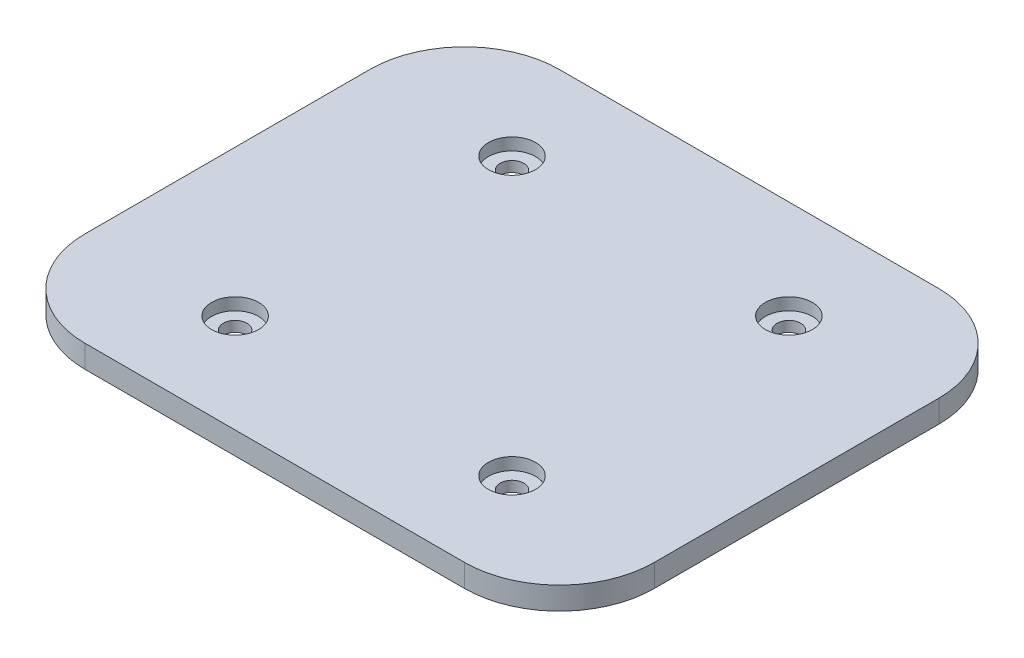
ISO-10303-21;
HEADER;
FILE_DESCRIPTION(('STEP AP214'),'2;1');
FILE_NAME('part.step','',(''),(''),'','','');
FILE_SCHEMA(('AUTOMOTIVE_DESIGN { 1 0 10303 214 1 1 1 1 }'));
ENDSEC;
DATA;
#1=APPLICATION_CONTEXT('core data for automotive mechanical design processes');
#2=APPLICATION_PROTOCOL_DEFINITION('international standard','automotive_design',2000,#1);
#3=PRODUCT_CONTEXT('',#1,'mechanical');
#4=PRODUCT('Part','Part','',(#3));
#5=PRODUCT_RELATED_PRODUCT_CATEGORY('part','',(#4));
#6=PRODUCT_DEFINITION_FORMATION('','',#4);
#7=PRODUCT_DEFINITION_CONTEXT('part definition',#1,'design');
#8=PRODUCT_DEFINITION('design','',#6,#7);
#9=PRODUCT_DEFINITION_SHAPE('','',#8);
#10=(LENGTH_UNIT() NAMED_UNIT(*) SI_UNIT(.MILLI.,.METRE.));
#11=(NAMED_UNIT(*) PLANE_ANGLE_UNIT() SI_UNIT($,.RADIAN.));
#12=(NAMED_UNIT(*) SI_UNIT($,.STERADIAN.) SOLID_ANGLE_UNIT());
#13=UNCERTAINTY_MEASURE_WITH_UNIT(LENGTH_MEASURE(1.E-05),#10,'distance_accuracy_value','');
#14=(GEOMETRIC_REPRESENTATION_CONTEXT(3) GLOBAL_UNCERTAINTY_ASSIGNED_CONTEXT((#13)) GLOBAL_UNIT_ASSIGNED_CONTEXT((#10,
#11,#12)) REPRESENTATION_CONTEXT('',''));
#15=CARTESIAN_POINT('',(0.,0.,0.));
#16=DIRECTION('',(0.,0.,1.));
#17=DIRECTION('',(1.,0.,0.));
#18=AXIS2_PLACEMENT_3D('',#15,#16,#17);
#19=CARTESIAN_POINT('',(-40.,4.7625,30.));
#20=DIRECTION('',(0.,-1.,0.));
#21=DIRECTION('',(0.,0.,-1.));
#22=AXIS2_PLACEMENT_3D('',#19,#20,#21);
#23=CYLINDRICAL_SURFACE('',#22,20.);
#24=CARTESIAN_POINT('',(-40.,0.,30.));
#25=DIRECTION('',(0.,1.,0.));
#26=DIRECTION('',(0.,0.,-1.));
#27=AXIS2_PLACEMENT_3D('',#24,#25,#26);
#28=CIRCLE('',#27,20.);
#29=CARTESIAN_POINT('',(-60.,0.,30.));
#30=VERTEX_POINT('',#29);
#31=CARTESIAN_POINT('',(-40.,0.,50.));
#32=VERTEX_POINT('',#31);
#33=EDGE_CURVE('E132',#30,#32,#28,.T.);
#34=ORIENTED_EDGE('',*,*,#33,.T.);
#35=DIRECTION('',(0.,-1.,0.));
#36=VECTOR('',#35,1.);
#37=CARTESIAN_POINT('',(-40.,4.7625,50.));
#38=LINE('',#37,#36);
#39=CARTESIAN_POINT('',(-40.,4.7625,50.));
#40=VERTEX_POINT('',#39);
#41=EDGE_CURVE('E11',#40,#32,#38,.T.);
#42=ORIENTED_EDGE('',*,*,#41,.F.);
#43=CARTESIAN_POINT('',(-40.,4.7625,30.));
#44=DIRECTION('',(0.,1.,0.));
#45=DIRECTION('',(0.,0.,-1.));
#46=AXIS2_PLACEMENT_3D('',#43,#44,#45);
#47=CIRCLE('',#46,20.);
#48=CARTESIAN_POINT('',(-60.,4.7625,30.));
#49=VERTEX_POINT('',#48);
#50=EDGE_CURVE('E147',#49,#40,#47,.T.);
#51=ORIENTED_EDGE('',*,*,#50,.F.);
#52=DIRECTION('',(0.,-1.,0.));
#53=VECTOR('',#52,1.);
#54=CARTESIAN_POINT('',(-60.,4.7625,30.));
#55=LINE('',#54,#53);
#56=EDGE_CURVE('E128',#49,#30,#55,.T.);
#57=ORIENTED_EDGE('',*,*,#56,.T.);
#58=EDGE_LOOP('',(#34,#42,#51,#57));
#59=FACE_BOUND('',#58,.T.);
#60=ADVANCED_FACE('F36',(#59),#23,.T.);
#61=CARTESIAN_POINT('',(40.,4.7625,50.));
#62=DIRECTION('',(0.,0.,-1.));
#63=DIRECTION('',(-1.,0.,0.));
#64=AXIS2_PLACEMENT_3D('',#61,#62,#63);
#65=PLANE('',#64);
#66=DIRECTION('',(1.,0.,0.));
#67=VECTOR('',#66,1.);
#68=CARTESIAN_POINT('',(40.,0.,50.));
#69=LINE('',#68,#67);
#70=CARTESIAN_POINT('',(40.,0.,50.));
#71=VERTEX_POINT('',#70);
#72=EDGE_CURVE('E135',#32,#71,#69,.T.);
#73=ORIENTED_EDGE('',*,*,#72,.T.);
#74=DIRECTION('',(0.,-1.,0.));
#75=VECTOR('',#74,1.);
#76=CARTESIAN_POINT('',(40.,4.7625,50.));
#77=LINE('',#76,#75);
#78=CARTESIAN_POINT('',(40.,4.7625,50.));
#79=VERTEX_POINT('',#78);
#80=EDGE_CURVE('E44',#79,#71,#77,.T.);
#81=ORIENTED_EDGE('',*,*,#80,.F.);
#82=DIRECTION('',(1.,0.,0.));
#83=VECTOR('',#82,1.);
#84=CARTESIAN_POINT('',(40.,4.7625,50.));
#85=LINE('',#84,#83);
#86=EDGE_CURVE('E95',#40,#79,#85,.T.);
#87=ORIENTED_EDGE('',*,*,#86,.F.);
#88=ORIENTED_EDGE('',*,*,#41,.T.);
#89=EDGE_LOOP('',(#73,#81,#87,#88));
#90=FACE_BOUND('',#89,.T.);
#91=ADVANCED_FACE('F258',(#90),#65,.F.);
#92=CARTESIAN_POINT('',(40.,4.7625,30.));
#93=DIRECTION('',(0.,-1.,0.));
#94=DIRECTION('',(0.,0.,-1.));
#95=AXIS2_PLACEMENT_3D('',#92,#93,#94);
#96=CYLINDRICAL_SURFACE('',#95,20.);
#97=CARTESIAN_POINT('',(40.,0.,30.));
#98=DIRECTION('',(0.,1.,0.));
#99=DIRECTION('',(0.,0.,1.));
#100=AXIS2_PLACEMENT_3D('',#97,#98,#99);
#101=CIRCLE('',#100,20.);
#102=CARTESIAN_POINT('',(60.,0.,30.));
#103=VERTEX_POINT('',#102);
#104=EDGE_CURVE('E138',#71,#103,#101,.T.);
#105=ORIENTED_EDGE('',*,*,#104,.T.);
#106=DIRECTION('',(0.,-1.,0.));
#107=VECTOR('',#106,1.);
#108=CARTESIAN_POINT('',(60.,4.7625,30.));
#109=LINE('',#108,#107);
#110=CARTESIAN_POINT('',(60.,4.7625,30.));
#111=VERTEX_POINT('',#110);
#112=EDGE_CURVE('E154',#111,#103,#109,.T.);
#113=ORIENTED_EDGE('',*,*,#112,.F.);
#114=CARTESIAN_POINT('',(40.,4.7625,30.));
#115=DIRECTION('',(0.,1.,0.));
#116=DIRECTION('',(0.,0.,1.));
#117=AXIS2_PLACEMENT_3D('',#114,#115,#116);
#118=CIRCLE('',#117,20.);
#119=EDGE_CURVE('E162',#79,#111,#118,.T.);
#120=ORIENTED_EDGE('',*,*,#119,.F.);
#121=ORIENTED_EDGE('',*,*,#80,.T.);
#122=EDGE_LOOP('',(#105,#113,#120,#121));
#123=FACE_BOUND('',#122,.T.);
#124=ADVANCED_FACE('F160',(#123),#96,.T.);
#125=CARTESIAN_POINT('',(60.,4.7625,30.));
#126=DIRECTION('',(-1.,0.,0.));
#127=DIRECTION('',(0.,0.,1.));
#128=AXIS2_PLACEMENT_3D('',#125,#126,#127);
#129=PLANE('',#128);
#130=DIRECTION('',(0.,0.,-1.));
#131=VECTOR('',#130,1.);
#132=CARTESIAN_POINT('',(60.,0.,30.));
#133=LINE('',#132,#131);
#134=CARTESIAN_POINT('',(59.9999999999999,0.,-30.));
#135=VERTEX_POINT('',#134);
#136=EDGE_CURVE('E140',#103,#135,#133,.T.);
#137=ORIENTED_EDGE('',*,*,#136,.T.);
#138=DIRECTION('',(0.,-1.,0.));
#139=VECTOR('',#138,1.);
#140=CARTESIAN_POINT('',(59.9999999999999,4.7625,-30.));
#141=LINE('',#140,#139);
#142=CARTESIAN_POINT('',(59.9999999999999,4.7625,-30.));
#143=VERTEX_POINT('',#142);
#144=EDGE_CURVE('E151',#143,#135,#141,.T.);
#145=ORIENTED_EDGE('',*,*,#144,.F.);
#146=DIRECTION('',(0.,0.,-1.));
#147=VECTOR('',#146,1.);
#148=CARTESIAN_POINT('',(60.,4.7625,30.));
#149=LINE('',#148,#147);
#150=EDGE_CURVE('E174',#111,#143,#149,.T.);
#151=ORIENTED_EDGE('',*,*,#150,.F.);
#152=ORIENTED_EDGE('',*,*,#112,.T.);
#153=EDGE_LOOP('',(#137,#145,#151,#152));
#154=FACE_BOUND('',#153,.T.);
#155=ADVANCED_FACE('F170',(#154),#129,.F.);
#156=CARTESIAN_POINT('',(40.,4.7625,-30.));
#157=DIRECTION('',(0.,-1.,0.));
#158=DIRECTION('',(0.,0.,-1.));
#159=AXIS2_PLACEMENT_3D('',#156,#157,#158);
#160=CYLINDRICAL_SURFACE('',#159,20.);
#161=CARTESIAN_POINT('',(40.,0.,-30.));
#162=DIRECTION('',(0.,1.,0.));
#163=DIRECTION('',(0.,0.,1.));
#164=AXIS2_PLACEMENT_3D('',#161,#162,#163);
#165=CIRCLE('',#164,20.);
#166=CARTESIAN_POINT('',(39.9999999999999,0.,-50.));
#167=VERTEX_POINT('',#166);
#168=EDGE_CURVE('E142',#135,#167,#165,.T.);
#169=ORIENTED_EDGE('',*,*,#168,.T.);
#170=DIRECTION('',(0.,-1.,0.));
#171=VECTOR('',#170,1.);
#172=CARTESIAN_POINT('',(39.9999999999999,4.7625,-50.));
#173=LINE('',#172,#171);
#174=CARTESIAN_POINT('',(39.9999999999999,4.7625,-50.));
#175=VERTEX_POINT('',#174);
#176=EDGE_CURVE('E123',#175,#167,#173,.T.);
#177=ORIENTED_EDGE('',*,*,#176,.F.);
#178=CARTESIAN_POINT('',(40.,4.7625,-30.));
#179=DIRECTION('',(0.,1.,0.));
#180=DIRECTION('',(0.,0.,1.));
#181=AXIS2_PLACEMENT_3D('',#178,#179,#180);
#182=CIRCLE('',#181,20.);
#183=EDGE_CURVE('E114',#143,#175,#182,.T.);
#184=ORIENTED_EDGE('',*,*,#183,.F.);
#185=ORIENTED_EDGE('',*,*,#144,.T.);
#186=EDGE_LOOP('',(#169,#177,#184,#185));
#187=FACE_BOUND('',#186,.T.);
#188=ADVANCED_FACE('F173',(#187),#160,.T.);
#189=CARTESIAN_POINT('',(39.9999999999999,4.7625,-50.));
#190=DIRECTION('',(0.,0.,1.));
#191=DIRECTION('',(1.,0.,0.));
#192=AXIS2_PLACEMENT_3D('',#189,#190,#191);
#193=PLANE('',#192);
#194=DIRECTION('',(-1.,0.,0.));
#195=VECTOR('',#194,1.);
#196=CARTESIAN_POINT('',(39.9999999999999,0.,-50.));
#197=LINE('',#196,#195);
#198=CARTESIAN_POINT('',(-40.,0.,-50.));
#199=VERTEX_POINT('',#198);
#200=EDGE_CURVE('E122',#167,#199,#197,.T.);
#201=ORIENTED_EDGE('',*,*,#200,.T.);
#202=DIRECTION('',(0.,-1.,0.));
#203=VECTOR('',#202,1.);
#204=CARTESIAN_POINT('',(-40.,4.7625,-50.));
#205=LINE('',#204,#203);
#206=CARTESIAN_POINT('',(-40.,4.7625,-50.));
#207=VERTEX_POINT('',#206);
#208=EDGE_CURVE('E119',#207,#199,#205,.T.);
#209=ORIENTED_EDGE('',*,*,#208,.F.);
#210=DIRECTION('',(-1.,0.,0.));
#211=VECTOR('',#210,1.);
#212=CARTESIAN_POINT('',(39.9999999999999,4.7625,-50.));
#213=LINE('',#212,#211);
#214=EDGE_CURVE('E108',#175,#207,#213,.T.);
#215=ORIENTED_EDGE('',*,*,#214,.F.);
#216=ORIENTED_EDGE('',*,*,#176,.T.);
#217=EDGE_LOOP('',(#201,#209,#215,#216));
#218=FACE_BOUND('',#217,.T.);
#219=ADVANCED_FACE('F120',(#218),#193,.F.);
#220=CARTESIAN_POINT('',(-40.,4.7625,-30.));
#221=DIRECTION('',(0.,-1.,0.));
#222=DIRECTION('',(0.,0.,-1.));
#223=AXIS2_PLACEMENT_3D('',#220,#221,#222);
#224=CYLINDRICAL_SURFACE('',#223,20.);
#225=CARTESIAN_POINT('',(-40.,0.,-30.));
#226=DIRECTION('',(0.,1.,0.));
#227=DIRECTION('',(0.,0.,1.));
#228=AXIS2_PLACEMENT_3D('',#225,#226,#227);
#229=CIRCLE('',#228,20.);
#230=CARTESIAN_POINT('',(-60.,0.,-30.));
#231=VERTEX_POINT('',#230);
#232=EDGE_CURVE('E81',#199,#231,#229,.T.);
#233=ORIENTED_EDGE('',*,*,#232,.T.);
#234=DIRECTION('',(0.,-1.,0.));
#235=VECTOR('',#234,1.);
#236=CARTESIAN_POINT('',(-60.,4.7625,-30.));
#237=LINE('',#236,#235);
#238=CARTESIAN_POINT('',(-60.,4.7625,-30.));
#239=VERTEX_POINT('',#238);
#240=EDGE_CURVE('E124',#239,#231,#237,.T.);
#241=ORIENTED_EDGE('',*,*,#240,.F.);
#242=CARTESIAN_POINT('',(-40.,4.7625,-30.));
#243=DIRECTION('',(0.,1.,0.));
#244=DIRECTION('',(0.,0.,1.));
#245=AXIS2_PLACEMENT_3D('',#242,#243,#244);
#246=CIRCLE('',#245,20.);
#247=EDGE_CURVE('E112',#207,#239,#246,.T.);
#248=ORIENTED_EDGE('',*,*,#247,.F.);
#249=ORIENTED_EDGE('',*,*,#208,.T.);
#250=EDGE_LOOP('',(#233,#241,#248,#249));
#251=FACE_BOUND('',#250,.T.);
#252=ADVANCED_FACE('F126',(#251),#224,.T.);
#253=CARTESIAN_POINT('',(-60.,4.7625,30.));
#254=DIRECTION('',(1.,0.,0.));
#255=DIRECTION('',(0.,0.,-1.));
#256=AXIS2_PLACEMENT_3D('',#253,#254,#255);
#257=PLANE('',#256);
#258=DIRECTION('',(0.,0.,1.));
#259=VECTOR('',#258,1.);
#260=CARTESIAN_POINT('',(-60.,0.,30.));
#261=LINE('',#260,#259);
#262=EDGE_CURVE('E87',#231,#30,#261,.T.);
#263=ORIENTED_EDGE('',*,*,#262,.T.);
#264=ORIENTED_EDGE('',*,*,#56,.F.);
#265=DIRECTION('',(0.,0.,1.));
#266=VECTOR('',#265,1.);
#267=CARTESIAN_POINT('',(-60.,4.7625,30.));
#268=LINE('',#267,#266);
#269=EDGE_CURVE('E52',#239,#49,#268,.T.);
#270=ORIENTED_EDGE('',*,*,#269,.F.);
#271=ORIENTED_EDGE('',*,*,#240,.T.);
#272=EDGE_LOOP('',(#263,#264,#270,#271));
#273=FACE_BOUND('',#272,.T.);
#274=ADVANCED_FACE('F232',(#273),#257,.F.);
#275=CARTESIAN_POINT('',(-40.,4.7625,30.));
#276=DIRECTION('',(0.,-1.,0.));
#277=DIRECTION('',(0.,0.,-1.));
#278=AXIS2_PLACEMENT_3D('',#275,#276,#277);
#279=PLANE('',#278);
#280=CARTESIAN_POINT('',(29.1858323934746,4.7625,-29.1858323934749));
#281=DIRECTION('',(0.,1.,0.));
#282=DIRECTION('',(0.,0.,1.));
#283=AXIS2_PLACEMENT_3D('',#280,#281,#282);
#284=CIRCLE('',#283,4.96062);
#285=CARTESIAN_POINT('',(29.1858323934746,4.7625,-24.2252123934749));
#286=VERTEX_POINT('',#285);
#287=EDGE_CURVE('E224',#286,#286,#284,.T.);
#288=ORIENTED_EDGE('',*,*,#287,.F.);
#289=EDGE_LOOP('',(#288));
#290=FACE_BOUND('',#289,.T.);
#291=CARTESIAN_POINT('',(29.1858323934749,4.7625,29.1858323934746));
#292=DIRECTION('',(0.,1.,0.));
#293=DIRECTION('',(0.,0.,1.));
#294=AXIS2_PLACEMENT_3D('',#291,#292,#293);
#295=CIRCLE('',#294,4.96062);
#296=CARTESIAN_POINT('',(29.1858323934749,4.7625,34.1464523934746));
#297=VERTEX_POINT('',#296);
#298=EDGE_CURVE('E212',#297,#297,#295,.T.);
#299=ORIENTED_EDGE('',*,*,#298,.F.);
#300=EDGE_LOOP('',(#299));
#301=FACE_BOUND('',#300,.T.);
#302=CARTESIAN_POINT('',(-29.1858323934746,4.7625,29.1858323934749));
#303=DIRECTION('',(0.,1.,0.));
#304=DIRECTION('',(0.,0.,1.));
#305=AXIS2_PLACEMENT_3D('',#302,#303,#304);
#306=CIRCLE('',#305,4.96062);
#307=CARTESIAN_POINT('',(-29.1858323934746,4.7625,34.1464523934749));
#308=VERTEX_POINT('',#307);
#309=EDGE_CURVE('E200',#308,#308,#306,.T.);
#310=ORIENTED_EDGE('',*,*,#309,.F.);
#311=EDGE_LOOP('',(#310));
#312=FACE_BOUND('',#311,.T.);
#313=CARTESIAN_POINT('',(-29.1858323934749,4.7625,-29.1858323934746));
#314=DIRECTION('',(0.,1.,0.));
#315=DIRECTION('',(0.,0.,1.));
#316=AXIS2_PLACEMENT_3D('',#313,#314,#315);
#317=CIRCLE('',#316,4.96062);
#318=CARTESIAN_POINT('',(-29.1858323934749,4.7625,-24.2252123934746));
#319=VERTEX_POINT('',#318);
#320=EDGE_CURVE('E188',#319,#319,#317,.T.);
#321=ORIENTED_EDGE('',*,*,#320,.F.);
#322=EDGE_LOOP('',(#321));
#323=FACE_BOUND('',#322,.T.);
#324=ORIENTED_EDGE('',*,*,#50,.T.);
#325=ORIENTED_EDGE('',*,*,#86,.T.);
#326=ORIENTED_EDGE('',*,*,#119,.T.);
#327=ORIENTED_EDGE('',*,*,#150,.T.);
#328=ORIENTED_EDGE('',*,*,#183,.T.);
#329=ORIENTED_EDGE('',*,*,#214,.T.);
#330=ORIENTED_EDGE('',*,*,#247,.T.);
#331=ORIENTED_EDGE('',*,*,#269,.T.);
#332=EDGE_LOOP('',(#324,#325,#326,#327,#328,#329,#330,#331));
#333=FACE_BOUND('',#332,.T.);
#334=ADVANCED_FACE('F110',(#290,#301,#312,#323,#333),#279,.F.);
#335=CARTESIAN_POINT('',(-40.,0.,30.));
#336=DIRECTION('',(0.,-1.,0.));
#337=DIRECTION('',(0.,0.,-1.));
#338=AXIS2_PLACEMENT_3D('',#335,#336,#337);
#339=PLANE('',#338);
#340=CARTESIAN_POINT('',(29.1858323934746,0.,-29.1858323934749));
#341=DIRECTION('',(0.,1.,0.));
#342=DIRECTION('',(0.,0.,1.));
#343=AXIS2_PLACEMENT_3D('',#340,#341,#342);
#344=CIRCLE('',#343,2.4892);
#345=CARTESIAN_POINT('',(29.1858323934746,0.,-26.6966323934749));
#346=VERTEX_POINT('',#345);
#347=EDGE_CURVE('E215',#346,#346,#344,.T.);
#348=ORIENTED_EDGE('',*,*,#347,.T.);
#349=EDGE_LOOP('',(#348));
#350=FACE_BOUND('',#349,.T.);
#351=CARTESIAN_POINT('',(29.1858323934749,0.,29.1858323934746));
#352=DIRECTION('',(0.,1.,0.));
#353=DIRECTION('',(0.,0.,1.));
#354=AXIS2_PLACEMENT_3D('',#351,#352,#353);
#355=CIRCLE('',#354,2.4892);
#356=CARTESIAN_POINT('',(29.1858323934749,0.,31.6750323934746));
#357=VERTEX_POINT('',#356);
#358=EDGE_CURVE('E203',#357,#357,#355,.T.);
#359=ORIENTED_EDGE('',*,*,#358,.T.);
#360=EDGE_LOOP('',(#359));
#361=FACE_BOUND('',#360,.T.);
#362=CARTESIAN_POINT('',(-29.1858323934746,0.,29.1858323934749));
#363=DIRECTION('',(0.,1.,0.));
#364=DIRECTION('',(0.,0.,1.));
#365=AXIS2_PLACEMENT_3D('',#362,#363,#364);
#366=CIRCLE('',#365,2.4892);
#367=CARTESIAN_POINT('',(-29.1858323934746,0.,31.6750323934749));
#368=VERTEX_POINT('',#367);
#369=EDGE_CURVE('E191',#368,#368,#366,.T.);
#370=ORIENTED_EDGE('',*,*,#369,.T.);
#371=EDGE_LOOP('',(#370));
#372=FACE_BOUND('',#371,.T.);
#373=CARTESIAN_POINT('',(-29.1858323934749,0.,-29.1858323934746));
#374=DIRECTION('',(0.,1.,0.));
#375=DIRECTION('',(0.,0.,1.));
#376=AXIS2_PLACEMENT_3D('',#373,#374,#375);
#377=CIRCLE('',#376,2.4892);
#378=CARTESIAN_POINT('',(-29.1858323934749,0.,-26.6966323934746));
#379=VERTEX_POINT('',#378);
#380=EDGE_CURVE('E136',#379,#379,#377,.T.);
#381=ORIENTED_EDGE('',*,*,#380,.T.);
#382=EDGE_LOOP('',(#381));
#383=FACE_BOUND('',#382,.T.);
#384=ORIENTED_EDGE('',*,*,#33,.F.);
#385=ORIENTED_EDGE('',*,*,#262,.F.);
#386=ORIENTED_EDGE('',*,*,#232,.F.);
#387=ORIENTED_EDGE('',*,*,#200,.F.);
#388=ORIENTED_EDGE('',*,*,#168,.F.);
#389=ORIENTED_EDGE('',*,*,#136,.F.);
#390=ORIENTED_EDGE('',*,*,#104,.F.);
#391=ORIENTED_EDGE('',*,*,#72,.F.);
#392=EDGE_LOOP('',(#384,#385,#386,#387,#388,#389,#390,#391));
#393=FACE_BOUND('',#392,.T.);
#394=ADVANCED_FACE('F166',(#350,#361,#372,#383,#393),#339,.T.);
#395=CARTESIAN_POINT('',(-29.1858323934749,4.7625,-29.1858323934746));
#396=DIRECTION('',(0.,1.,0.));
#397=DIRECTION('',(0.,0.,1.));
#398=AXIS2_PLACEMENT_3D('',#395,#396,#397);
#399=CYLINDRICAL_SURFACE('',#398,2.4892);
#400=ORIENTED_EDGE('',*,*,#380,.F.);
#401=EDGE_LOOP('',(#400));
#402=FACE_BOUND('',#401,.T.);
#403=CARTESIAN_POINT('',(-29.1858323934749,2.1971,-29.1858323934746));
#404=DIRECTION('',(0.,1.,0.));
#405=DIRECTION('',(0.,0.,1.));
#406=AXIS2_PLACEMENT_3D('',#403,#404,#405);
#407=CIRCLE('',#406,2.4892);
#408=CARTESIAN_POINT('',(-29.1858323934749,2.1971,-26.6966323934746));
#409=VERTEX_POINT('',#408);
#410=EDGE_CURVE('E182',#409,#409,#407,.T.);
#411=ORIENTED_EDGE('',*,*,#410,.T.);
#412=EDGE_LOOP('',(#411));
#413=FACE_BOUND('',#412,.T.);
#414=ADVANCED_FACE('F253',(#402,#413),#399,.F.);
#415=CARTESIAN_POINT('',(-26.6966323934749,2.1971,-29.1858323934746));
#416=DIRECTION('',(0.,-1.,0.));
#417=DIRECTION('',(0.,0.,-1.));
#418=AXIS2_PLACEMENT_3D('',#415,#416,#417);
#419=PLANE('',#418);
#420=ORIENTED_EDGE('',*,*,#410,.F.);
#421=EDGE_LOOP('',(#420));
#422=FACE_BOUND('',#421,.T.);
#423=CARTESIAN_POINT('',(-29.1858323934749,2.1971,-29.1858323934746));
#424=DIRECTION('',(0.,1.,0.));
#425=DIRECTION('',(0.,0.,1.));
#426=AXIS2_PLACEMENT_3D('',#423,#424,#425);
#427=CIRCLE('',#426,4.96062);
#428=CARTESIAN_POINT('',(-29.1858323934749,2.1971,-24.2252123934746));
#429=VERTEX_POINT('',#428);
#430=EDGE_CURVE('E185',#429,#429,#427,.T.);
#431=ORIENTED_EDGE('',*,*,#430,.T.);
#432=EDGE_LOOP('',(#431));
#433=FACE_BOUND('',#432,.T.);
#434=ADVANCED_FACE('F243',(#422,#433),#419,.F.);
#435=CARTESIAN_POINT('',(-29.1858323934749,4.7625,-29.1858323934746));
#436=DIRECTION('',(0.,1.,0.));
#437=DIRECTION('',(0.,0.,1.));
#438=AXIS2_PLACEMENT_3D('',#435,#436,#437);
#439=CYLINDRICAL_SURFACE('',#438,4.96062);
#440=ORIENTED_EDGE('',*,*,#430,.F.);
#441=EDGE_LOOP('',(#440));
#442=FACE_BOUND('',#441,.T.);
#443=ORIENTED_EDGE('',*,*,#320,.T.);
#444=EDGE_LOOP('',(#443));
#445=FACE_BOUND('',#444,.T.);
#446=ADVANCED_FACE('F240',(#442,#445),#439,.F.);
#447=CARTESIAN_POINT('',(-29.1858323934746,4.7625,29.1858323934749));
#448=DIRECTION('',(0.,1.,0.));
#449=DIRECTION('',(0.,0.,1.));
#450=AXIS2_PLACEMENT_3D('',#447,#448,#449);
#451=CYLINDRICAL_SURFACE('',#450,2.4892);
#452=ORIENTED_EDGE('',*,*,#369,.F.);
#453=EDGE_LOOP('',(#452));
#454=FACE_BOUND('',#453,.T.);
#455=CARTESIAN_POINT('',(-29.1858323934746,2.1971,29.1858323934749));
#456=DIRECTION('',(0.,1.,0.));
#457=DIRECTION('',(0.,0.,1.));
#458=AXIS2_PLACEMENT_3D('',#455,#456,#457);
#459=CIRCLE('',#458,2.4892);
#460=CARTESIAN_POINT('',(-29.1858323934746,2.1971,31.6750323934749));
#461=VERTEX_POINT('',#460);
#462=EDGE_CURVE('E194',#461,#461,#459,.T.);
#463=ORIENTED_EDGE('',*,*,#462,.T.);
#464=EDGE_LOOP('',(#463));
#465=FACE_BOUND('',#464,.T.);
#466=ADVANCED_FACE('F242',(#454,#465),#451,.F.);
#467=CARTESIAN_POINT('',(-26.6966323934746,2.1971,29.1858323934749));
#468=DIRECTION('',(0.,-1.,0.));
#469=DIRECTION('',(0.,0.,-1.));
#470=AXIS2_PLACEMENT_3D('',#467,#468,#469);
#471=PLANE('',#470);
#472=ORIENTED_EDGE('',*,*,#462,.F.);
#473=EDGE_LOOP('',(#472));
#474=FACE_BOUND('',#473,.T.);
#475=CARTESIAN_POINT('',(-29.1858323934746,2.1971,29.1858323934749));
#476=DIRECTION('',(0.,1.,0.));
#477=DIRECTION('',(0.,0.,1.));
#478=AXIS2_PLACEMENT_3D('',#475,#476,#477);
#479=CIRCLE('',#478,4.96062);
#480=CARTESIAN_POINT('',(-29.1858323934746,2.1971,34.1464523934749));
#481=VERTEX_POINT('',#480);
#482=EDGE_CURVE('E197',#481,#481,#479,.T.);
#483=ORIENTED_EDGE('',*,*,#482,.T.);
#484=EDGE_LOOP('',(#483));
#485=FACE_BOUND('',#484,.T.);
#486=ADVANCED_FACE('F250',(#474,#485),#471,.F.);
#487=CARTESIAN_POINT('',(-29.1858323934746,4.7625,29.1858323934749));
#488=DIRECTION('',(0.,1.,0.));
#489=DIRECTION('',(0.,0.,1.));
#490=AXIS2_PLACEMENT_3D('',#487,#488,#489);
#491=CYLINDRICAL_SURFACE('',#490,4.96062);
#492=ORIENTED_EDGE('',*,*,#482,.F.);
#493=EDGE_LOOP('',(#492));
#494=FACE_BOUND('',#493,.T.);
#495=ORIENTED_EDGE('',*,*,#309,.T.);
#496=EDGE_LOOP('',(#495));
#497=FACE_BOUND('',#496,.T.);
#498=ADVANCED_FACE('F352',(#494,#497),#491,.F.);
#499=CARTESIAN_POINT('',(29.1858323934749,4.7625,29.1858323934746));
#500=DIRECTION('',(0.,1.,0.));
#501=DIRECTION('',(0.,0.,1.));
#502=AXIS2_PLACEMENT_3D('',#499,#500,#501);
#503=CYLINDRICAL_SURFACE('',#502,2.4892);
#504=ORIENTED_EDGE('',*,*,#358,.F.);
#505=EDGE_LOOP('',(#504));
#506=FACE_BOUND('',#505,.T.);
#507=CARTESIAN_POINT('',(29.1858323934749,2.1971,29.1858323934746));
#508=DIRECTION('',(0.,1.,0.));
#509=DIRECTION('',(0.,0.,1.));
#510=AXIS2_PLACEMENT_3D('',#507,#508,#509);
#511=CIRCLE('',#510,2.4892);
#512=CARTESIAN_POINT('',(29.1858323934749,2.1971,31.6750323934746));
#513=VERTEX_POINT('',#512);
#514=EDGE_CURVE('E206',#513,#513,#511,.T.);
#515=ORIENTED_EDGE('',*,*,#514,.T.);
#516=EDGE_LOOP('',(#515));
#517=FACE_BOUND('',#516,.T.);
#518=ADVANCED_FACE('F362',(#506,#517),#503,.F.);
#519=CARTESIAN_POINT('',(31.6750323934749,2.1971,29.1858323934746));
#520=DIRECTION('',(0.,-1.,0.));
#521=DIRECTION('',(0.,0.,-1.));
#522=AXIS2_PLACEMENT_3D('',#519,#520,#521);
#523=PLANE('',#522);
#524=ORIENTED_EDGE('',*,*,#514,.F.);
#525=EDGE_LOOP('',(#524));
#526=FACE_BOUND('',#525,.T.);
#527=CARTESIAN_POINT('',(29.1858323934749,2.1971,29.1858323934746));
#528=DIRECTION('',(0.,1.,0.));
#529=DIRECTION('',(0.,0.,1.));
#530=AXIS2_PLACEMENT_3D('',#527,#528,#529);
#531=CIRCLE('',#530,4.96062);
#532=CARTESIAN_POINT('',(29.1858323934749,2.1971,34.1464523934746));
#533=VERTEX_POINT('',#532);
#534=EDGE_CURVE('E209',#533,#533,#531,.T.);
#535=ORIENTED_EDGE('',*,*,#534,.T.);
#536=EDGE_LOOP('',(#535));
#537=FACE_BOUND('',#536,.T.);
#538=ADVANCED_FACE('F372',(#526,#537),#523,.F.);
#539=CARTESIAN_POINT('',(29.1858323934749,4.7625,29.1858323934746));
#540=DIRECTION('',(0.,1.,0.));
#541=DIRECTION('',(0.,0.,1.));
#542=AXIS2_PLACEMENT_3D('',#539,#540,#541);
#543=CYLINDRICAL_SURFACE('',#542,4.96062);
#544=ORIENTED_EDGE('',*,*,#534,.F.);
#545=EDGE_LOOP('',(#544));
#546=FACE_BOUND('',#545,.T.);
#547=ORIENTED_EDGE('',*,*,#298,.T.);
#548=EDGE_LOOP('',(#547));
#549=FACE_BOUND('',#548,.T.);
#550=ADVANCED_FACE('F382',(#546,#549),#543,.F.);
#551=CARTESIAN_POINT('',(29.1858323934746,4.7625,-29.1858323934749));
#552=DIRECTION('',(0.,1.,0.));
#553=DIRECTION('',(0.,0.,1.));
#554=AXIS2_PLACEMENT_3D('',#551,#552,#553);
#555=CYLINDRICAL_SURFACE('',#554,2.4892);
#556=ORIENTED_EDGE('',*,*,#347,.F.);
#557=EDGE_LOOP('',(#556));
#558=FACE_BOUND('',#557,.T.);
#559=CARTESIAN_POINT('',(29.1858323934746,2.1971,-29.1858323934749));
#560=DIRECTION('',(0.,1.,0.));
#561=DIRECTION('',(0.,0.,1.));
#562=AXIS2_PLACEMENT_3D('',#559,#560,#561);
#563=CIRCLE('',#562,2.4892);
#564=CARTESIAN_POINT('',(29.1858323934746,2.1971,-26.6966323934749));
#565=VERTEX_POINT('',#564);
#566=EDGE_CURVE('E218',#565,#565,#563,.T.);
#567=ORIENTED_EDGE('',*,*,#566,.T.);
#568=EDGE_LOOP('',(#567));
#569=FACE_BOUND('',#568,.T.);
#570=ADVANCED_FACE('F392',(#558,#569),#555,.F.);
#571=CARTESIAN_POINT('',(31.6750323934746,2.1971,-29.1858323934749));
#572=DIRECTION('',(0.,-1.,0.));
#573=DIRECTION('',(0.,0.,-1.));
#574=AXIS2_PLACEMENT_3D('',#571,#572,#573);
#575=PLANE('',#574);
#576=ORIENTED_EDGE('',*,*,#566,.F.);
#577=EDGE_LOOP('',(#576));
#578=FACE_BOUND('',#577,.T.);
#579=CARTESIAN_POINT('',(29.1858323934746,2.1971,-29.1858323934749));
#580=DIRECTION('',(0.,1.,0.));
#581=DIRECTION('',(0.,0.,1.));
#582=AXIS2_PLACEMENT_3D('',#579,#580,#581);
#583=CIRCLE('',#582,4.96062);
#584=CARTESIAN_POINT('',(29.1858323934746,2.1971,-24.2252123934749));
#585=VERTEX_POINT('',#584);
#586=EDGE_CURVE('E221',#585,#585,#583,.T.);
#587=ORIENTED_EDGE('',*,*,#586,.T.);
#588=EDGE_LOOP('',(#587));
#589=FACE_BOUND('',#588,.T.);
#590=ADVANCED_FACE('F402',(#578,#589),#575,.F.);
#591=CARTESIAN_POINT('',(29.1858323934746,4.7625,-29.1858323934749));
#592=DIRECTION('',(0.,1.,0.));
#593=DIRECTION('',(0.,0.,1.));
#594=AXIS2_PLACEMENT_3D('',#591,#592,#593);
#595=CYLINDRICAL_SURFACE('',#594,4.96062);
#596=ORIENTED_EDGE('',*,*,#586,.F.);
#597=EDGE_LOOP('',(#596));
#598=FACE_BOUND('',#597,.T.);
#599=ORIENTED_EDGE('',*,*,#287,.T.);
#600=EDGE_LOOP('',(#599));
#601=FACE_BOUND('',#600,.T.);
#602=ADVANCED_FACE('F228',(#598,#601),#595,.F.);
#603=CLOSED_SHELL('',(#60,#91,#124,#155,#188,#219,#252,#274,#334,#394,#414,#434,#446,#466,#486,
#498,#518,#538,#550,#570,#590,#602));
#604=MANIFOLD_SOLID_BREP('B2',#603);
#605=ADVANCED_BREP_SHAPE_REPRESENTATION('',(#18,#604),#14);
#606=SHAPE_DEFINITION_REPRESENTATION(#9,#605);
ENDSEC;
END-ISO-10303-21;
